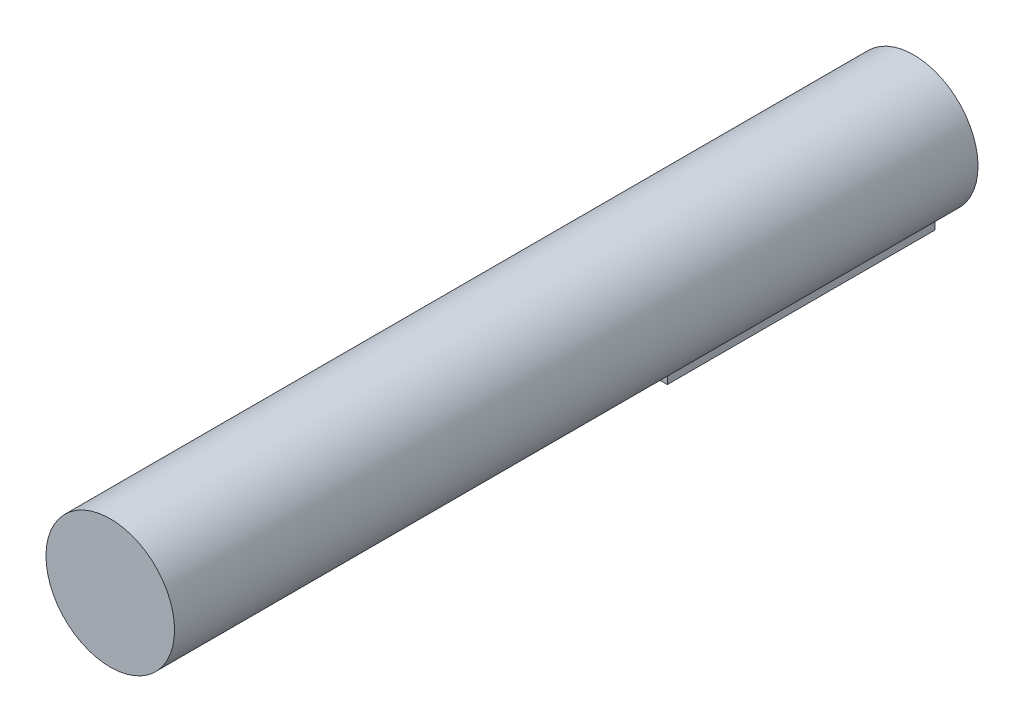
ISO-10303-21;
HEADER;
FILE_DESCRIPTION(('STEP AP214'),'2;1');
FILE_NAME('part.step','',(''),(''),'','','');
FILE_SCHEMA(('AUTOMOTIVE_DESIGN { 1 0 10303 214 1 1 1 1 }'));
ENDSEC;
DATA;
#1=APPLICATION_CONTEXT('core data for automotive mechanical design processes');
#2=APPLICATION_PROTOCOL_DEFINITION('international standard','automotive_design',2000,#1);
#3=PRODUCT_CONTEXT('',#1,'mechanical');
#4=PRODUCT('Part','Part','',(#3));
#5=PRODUCT_RELATED_PRODUCT_CATEGORY('part','',(#4));
#6=PRODUCT_DEFINITION_FORMATION('','',#4);
#7=PRODUCT_DEFINITION_CONTEXT('part definition',#1,'design');
#8=PRODUCT_DEFINITION('design','',#6,#7);
#9=PRODUCT_DEFINITION_SHAPE('','',#8);
#10=(LENGTH_UNIT() NAMED_UNIT(*) SI_UNIT(.MILLI.,.METRE.));
#11=(NAMED_UNIT(*) PLANE_ANGLE_UNIT() SI_UNIT($,.RADIAN.));
#12=(NAMED_UNIT(*) SI_UNIT($,.STERADIAN.) SOLID_ANGLE_UNIT());
#13=UNCERTAINTY_MEASURE_WITH_UNIT(LENGTH_MEASURE(1.E-05),#10,'distance_accuracy_value','');
#14=(GEOMETRIC_REPRESENTATION_CONTEXT(3) GLOBAL_UNCERTAINTY_ASSIGNED_CONTEXT((#13)) GLOBAL_UNIT_ASSIGNED_CONTEXT((#10,
#11,#12)) REPRESENTATION_CONTEXT('',''));
#15=CARTESIAN_POINT('',(0.,0.,0.));
#16=DIRECTION('',(0.,0.,1.));
#17=DIRECTION('',(1.,0.,0.));
#18=AXIS2_PLACEMENT_3D('',#15,#16,#17);
#19=CARTESIAN_POINT('',(-4.,0.,50.));
#20=DIRECTION('',(-1.,0.,0.));
#21=DIRECTION('',(0.,0.,1.));
#22=AXIS2_PLACEMENT_3D('',#19,#20,#21);
#23=PLANE('',#22);
#24=DIRECTION('',(0.,1.,0.));
#25=VECTOR('',#24,1.);
#26=CARTESIAN_POINT('',(-4.,0.,0.));
#27=LINE('',#26,#25);
#28=CARTESIAN_POINT('',(-4.,-14.3137084989848,0.));
#29=VERTEX_POINT('',#28);
#30=CARTESIAN_POINT('',(-4.,-11.3137084989848,0.));
#31=VERTEX_POINT('',#30);
#32=EDGE_CURVE('E74',#29,#31,#27,.T.);
#33=ORIENTED_EDGE('',*,*,#32,.F.);
#34=DIRECTION('',(0.,0.,-1.));
#35=VECTOR('',#34,1.);
#36=CARTESIAN_POINT('',(-4.,-14.3137084989848,50.));
#37=LINE('',#36,#35);
#38=CARTESIAN_POINT('',(-4.,-14.3137084989848,50.));
#39=VERTEX_POINT('',#38);
#40=EDGE_CURVE('E41',#39,#29,#37,.T.);
#41=ORIENTED_EDGE('',*,*,#40,.F.);
#42=DIRECTION('',(0.,1.,0.));
#43=VECTOR('',#42,1.);
#44=CARTESIAN_POINT('',(-4.,0.,50.));
#45=LINE('',#44,#43);
#46=CARTESIAN_POINT('',(-4.,-11.3137084989848,50.));
#47=VERTEX_POINT('',#46);
#48=EDGE_CURVE('E93',#39,#47,#45,.T.);
#49=ORIENTED_EDGE('',*,*,#48,.T.);
#50=DIRECTION('',(0.,0.,-1.));
#51=VECTOR('',#50,1.);
#52=CARTESIAN_POINT('',(-4.,-11.3137084989848,50.));
#53=LINE('',#52,#51);
#54=EDGE_CURVE('E11',#47,#31,#53,.T.);
#55=ORIENTED_EDGE('',*,*,#54,.T.);
#56=EDGE_LOOP('',(#33,#41,#49,#55));
#57=FACE_BOUND('',#56,.T.);
#58=ADVANCED_FACE('F33',(#57),#23,.T.);
#59=CARTESIAN_POINT('',(0.,-14.3137084989848,50.));
#60=DIRECTION('',(0.,-1.,0.));
#61=DIRECTION('',(0.,0.,-1.));
#62=AXIS2_PLACEMENT_3D('',#59,#60,#61);
#63=PLANE('',#62);
#64=DIRECTION('',(-1.,0.,0.));
#65=VECTOR('',#64,1.);
#66=CARTESIAN_POINT('',(0.,-14.3137084989848,0.));
#67=LINE('',#66,#65);
#68=CARTESIAN_POINT('',(4.,-14.3137084989848,0.));
#69=VERTEX_POINT('',#68);
#70=EDGE_CURVE('E91',#69,#29,#67,.T.);
#71=ORIENTED_EDGE('',*,*,#70,.F.);
#72=DIRECTION('',(0.,0.,-1.));
#73=VECTOR('',#72,1.);
#74=CARTESIAN_POINT('',(4.,-14.3137084989848,50.));
#75=LINE('',#74,#73);
#76=CARTESIAN_POINT('',(4.,-14.3137084989848,50.));
#77=VERTEX_POINT('',#76);
#78=EDGE_CURVE('E49',#77,#69,#75,.T.);
#79=ORIENTED_EDGE('',*,*,#78,.F.);
#80=DIRECTION('',(-1.,0.,0.));
#81=VECTOR('',#80,1.);
#82=CARTESIAN_POINT('',(0.,-14.3137084989848,50.));
#83=LINE('',#82,#81);
#84=EDGE_CURVE('E99',#77,#39,#83,.T.);
#85=ORIENTED_EDGE('',*,*,#84,.T.);
#86=ORIENTED_EDGE('',*,*,#40,.T.);
#87=EDGE_LOOP('',(#71,#79,#85,#86));
#88=FACE_BOUND('',#87,.T.);
#89=ADVANCED_FACE('F98',(#88),#63,.T.);
#90=CARTESIAN_POINT('',(4.,0.,50.));
#91=DIRECTION('',(1.,0.,0.));
#92=DIRECTION('',(0.,0.,-1.));
#93=AXIS2_PLACEMENT_3D('',#90,#91,#92);
#94=PLANE('',#93);
#95=DIRECTION('',(0.,-1.,0.));
#96=VECTOR('',#95,1.);
#97=CARTESIAN_POINT('',(4.,0.,0.));
#98=LINE('',#97,#96);
#99=CARTESIAN_POINT('',(4.,-11.3137084989848,0.));
#100=VERTEX_POINT('',#99);
#101=EDGE_CURVE('E71',#100,#69,#98,.T.);
#102=ORIENTED_EDGE('',*,*,#101,.F.);
#103=DIRECTION('',(0.,0.,-1.));
#104=VECTOR('',#103,1.);
#105=CARTESIAN_POINT('',(4.,-11.3137084989848,50.));
#106=LINE('',#105,#104);
#107=CARTESIAN_POINT('',(4.,-11.3137084989848,50.));
#108=VERTEX_POINT('',#107);
#109=EDGE_CURVE('E81',#108,#100,#106,.T.);
#110=ORIENTED_EDGE('',*,*,#109,.F.);
#111=DIRECTION('',(0.,-1.,0.));
#112=VECTOR('',#111,1.);
#113=CARTESIAN_POINT('',(4.,0.,50.));
#114=LINE('',#113,#112);
#115=EDGE_CURVE('E88',#108,#77,#114,.T.);
#116=ORIENTED_EDGE('',*,*,#115,.T.);
#117=ORIENTED_EDGE('',*,*,#78,.T.);
#118=EDGE_LOOP('',(#102,#110,#116,#117));
#119=FACE_BOUND('',#118,.T.);
#120=ADVANCED_FACE('F90',(#119),#94,.T.);
#121=CARTESIAN_POINT('',(0.,0.,50.));
#122=DIRECTION('',(0.,0.,1.));
#123=DIRECTION('',(1.,0.,0.));
#124=AXIS2_PLACEMENT_3D('',#121,#122,#123);
#125=PLANE('',#124);
#126=CARTESIAN_POINT('',(0.,0.,50.));
#127=DIRECTION('',(0.,0.,1.));
#128=DIRECTION('',(1.,0.,0.));
#129=AXIS2_PLACEMENT_3D('',#126,#127,#128);
#130=CIRCLE('',#129,12.);
#131=EDGE_CURVE('E86',#47,#108,#130,.T.);
#132=ORIENTED_EDGE('',*,*,#131,.F.);
#133=ORIENTED_EDGE('',*,*,#48,.F.);
#134=ORIENTED_EDGE('',*,*,#84,.F.);
#135=ORIENTED_EDGE('',*,*,#115,.F.);
#136=EDGE_LOOP('',(#132,#133,#134,#135));
#137=FACE_BOUND('',#136,.T.);
#138=ADVANCED_FACE('F109',(#137),#125,.T.);
#139=CARTESIAN_POINT('',(0.,0.,0.));
#140=DIRECTION('',(0.,0.,1.));
#141=DIRECTION('',(1.,0.,0.));
#142=AXIS2_PLACEMENT_3D('',#139,#140,#141);
#143=PLANE('',#142);
#144=ORIENTED_EDGE('',*,*,#32,.T.);
#145=CARTESIAN_POINT('',(0.,0.,0.));
#146=DIRECTION('',(0.,0.,1.));
#147=DIRECTION('',(1.,0.,0.));
#148=AXIS2_PLACEMENT_3D('',#145,#146,#147);
#149=CIRCLE('',#148,12.);
#150=EDGE_CURVE('E67',#100,#31,#149,.T.);
#151=ORIENTED_EDGE('',*,*,#150,.F.);
#152=ORIENTED_EDGE('',*,*,#101,.T.);
#153=ORIENTED_EDGE('',*,*,#70,.T.);
#154=EDGE_LOOP('',(#144,#151,#152,#153));
#155=FACE_BOUND('',#154,.T.);
#156=ADVANCED_FACE('F69',(#155),#143,.F.);
#157=CARTESIAN_POINT('',(0.,0.,150.));
#158=DIRECTION('',(0.,0.,-1.));
#159=DIRECTION('',(-1.,0.,0.));
#160=AXIS2_PLACEMENT_3D('',#157,#158,#159);
#161=CYLINDRICAL_SURFACE('',#160,12.);
#162=ORIENTED_EDGE('',*,*,#54,.F.);
#163=ORIENTED_EDGE('',*,*,#131,.T.);
#164=ORIENTED_EDGE('',*,*,#109,.T.);
#165=ORIENTED_EDGE('',*,*,#150,.T.);
#166=EDGE_LOOP('',(#162,#163,#164,#165));
#167=FACE_BOUND('',#166,.T.);
#168=CARTESIAN_POINT('',(0.,0.,150.));
#169=DIRECTION('',(0.,0.,1.));
#170=DIRECTION('',(1.,0.,0.));
#171=AXIS2_PLACEMENT_3D('',#168,#169,#170);
#172=CIRCLE('',#171,12.);
#173=CARTESIAN_POINT('',(12.,0.,150.));
#174=VERTEX_POINT('',#173);
#175=EDGE_CURVE('E77',#174,#174,#172,.T.);
#176=ORIENTED_EDGE('',*,*,#175,.F.);
#177=EDGE_LOOP('',(#176));
#178=FACE_BOUND('',#177,.T.);
#179=ADVANCED_FACE('F82',(#167,#178),#161,.T.);
#180=CARTESIAN_POINT('',(0.,0.,150.));
#181=DIRECTION('',(0.,0.,1.));
#182=DIRECTION('',(1.,0.,0.));
#183=AXIS2_PLACEMENT_3D('',#180,#181,#182);
#184=PLANE('',#183);
#185=ORIENTED_EDGE('',*,*,#175,.T.);
#186=EDGE_LOOP('',(#185));
#187=FACE_BOUND('',#186,.T.);
#188=ADVANCED_FACE('F153',(#187),#184,.T.);
#189=CLOSED_SHELL('',(#58,#89,#120,#138,#156,#179,#188));
#190=MANIFOLD_SOLID_BREP('B2',#189);
#191=ADVANCED_BREP_SHAPE_REPRESENTATION('',(#18,#190),#14);
#192=SHAPE_DEFINITION_REPRESENTATION(#9,#191);
ENDSEC;
END-ISO-10303-21;
